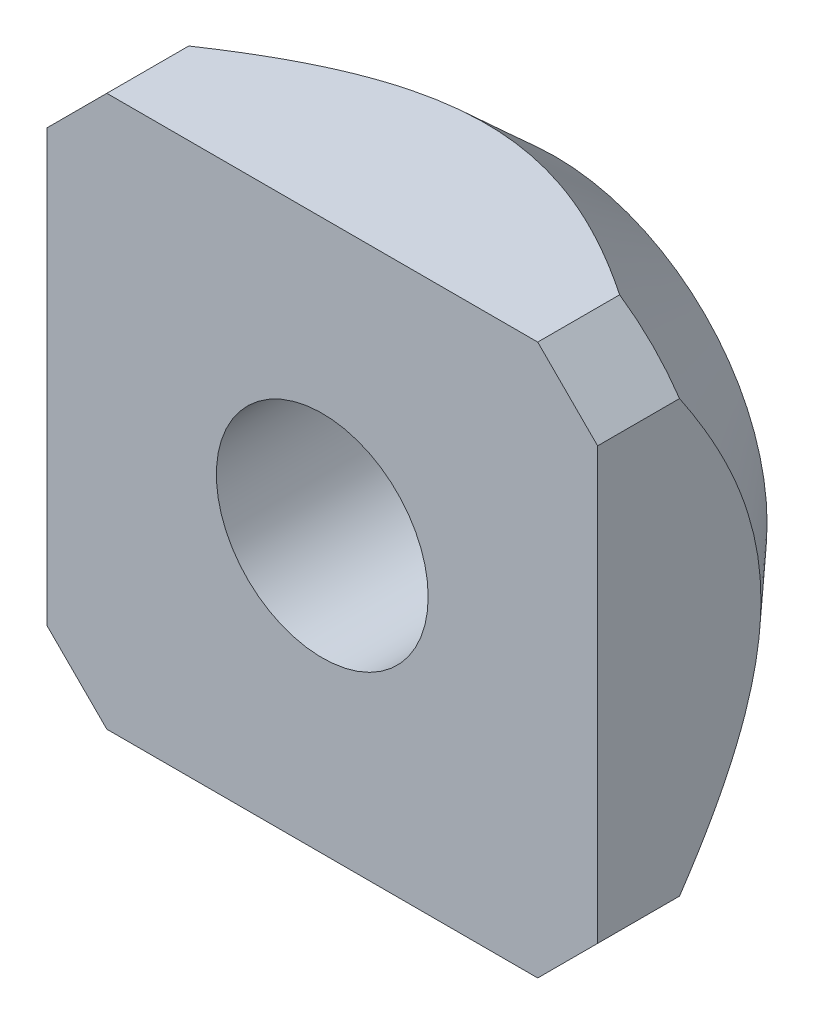
ISO-10303-21;
HEADER;
FILE_DESCRIPTION(('STEP AP214'),'2;1');
FILE_NAME('part.step','',(''),(''),'','','');
FILE_SCHEMA(('AUTOMOTIVE_DESIGN { 1 0 10303 214 1 1 1 1 }'));
ENDSEC;
DATA;
#1=APPLICATION_CONTEXT('core data for automotive mechanical design processes');
#2=APPLICATION_PROTOCOL_DEFINITION('international standard','automotive_design',2000,#1);
#3=PRODUCT_CONTEXT('',#1,'mechanical');
#4=PRODUCT('Part','Part','',(#3));
#5=PRODUCT_RELATED_PRODUCT_CATEGORY('part','',(#4));
#6=PRODUCT_DEFINITION_FORMATION('','',#4);
#7=PRODUCT_DEFINITION_CONTEXT('part definition',#1,'design');
#8=PRODUCT_DEFINITION('design','',#6,#7);
#9=PRODUCT_DEFINITION_SHAPE('','',#8);
#10=(LENGTH_UNIT() NAMED_UNIT(*) SI_UNIT(.MILLI.,.METRE.));
#11=(NAMED_UNIT(*) PLANE_ANGLE_UNIT() SI_UNIT($,.RADIAN.));
#12=(NAMED_UNIT(*) SI_UNIT($,.STERADIAN.) SOLID_ANGLE_UNIT());
#13=UNCERTAINTY_MEASURE_WITH_UNIT(LENGTH_MEASURE(1.E-05),#10,'distance_accuracy_value','');
#14=(GEOMETRIC_REPRESENTATION_CONTEXT(3) GLOBAL_UNCERTAINTY_ASSIGNED_CONTEXT((#13)) GLOBAL_UNIT_ASSIGNED_CONTEXT((#10,
#11,#12)) REPRESENTATION_CONTEXT('',''));
#15=CARTESIAN_POINT('',(0.,0.,0.));
#16=DIRECTION('',(0.,0.,1.));
#17=DIRECTION('',(1.,0.,0.));
#18=AXIS2_PLACEMENT_3D('',#15,#16,#17);
#19=CARTESIAN_POINT('',(0.,0.,-5.5));
#20=DIRECTION('',(0.,0.,1.));
#21=DIRECTION('',(1.,0.,0.));
#22=AXIS2_PLACEMENT_3D('',#19,#20,#21);
#23=PLANE('',#22);
#24=CARTESIAN_POINT('',(0.,0.,-5.5));
#25=DIRECTION('',(0.,0.,1.));
#26=DIRECTION('',(1.,0.,0.));
#27=AXIS2_PLACEMENT_3D('',#24,#25,#26);
#28=CIRCLE('',#27,2.5);
#29=CARTESIAN_POINT('',(2.5,0.,-5.5));
#30=VERTEX_POINT('',#29);
#31=EDGE_CURVE('E246',#30,#30,#28,.T.);
#32=ORIENTED_EDGE('',*,*,#31,.T.);
#33=EDGE_LOOP('',(#32));
#34=FACE_BOUND('',#33,.T.);
#35=CARTESIAN_POINT('',(0.,0.,-5.50000000287154));
#36=DIRECTION('',(0.,0.,1.));
#37=DIRECTION('',(1.,0.,0.));
#38=AXIS2_PLACEMENT_3D('',#35,#36,#37);
#39=CIRCLE('',#38,5.00000000314824);
#40=CARTESIAN_POINT('',(5.00000000314824,0.,-5.50000000287154));
#41=VERTEX_POINT('',#40);
#42=EDGE_CURVE('E33',#41,#41,#39,.T.);
#43=ORIENTED_EDGE('',*,*,#42,.F.);
#44=EDGE_LOOP('',(#43));
#45=FACE_BOUND('',#44,.T.);
#46=ADVANCED_FACE('F30',(#34,#45),#23,.F.);
#47=CARTESIAN_POINT('',(0.,0.,-1.91193420733516));
#48=DIRECTION('',(0.,0.,1.));
#49=DIRECTION('',(1.,0.,0.));
#50=AXIS2_PLACEMENT_3D('',#47,#48,#49);
#51=CONICAL_SURFACE('',#50,8.27271392518171,0.739466056088912);
#52=ORIENTED_EDGE('',*,*,#42,.T.);
#53=EDGE_LOOP('',(#52));
#54=FACE_BOUND('',#53,.T.);
#55=CARTESIAN_POINT('',(-6.49999999996656,5.08578643774263,-1.93333420218814));
#56=CARTESIAN_POINT('',(-6.49999999998799,4.97217656549041,-2.01007902749409));
#57=CARTESIAN_POINT('',(-6.49999999999678,4.85782950972393,-2.08574579284289));
#58=CARTESIAN_POINT('',(-6.50000000000322,4.62749756275461,-2.23459577320099));
#59=CARTESIAN_POINT('',(-6.50000000000086,4.51151233122406,-2.30777846107305));
#60=CARTESIAN_POINT('',(-6.49999999999913,4.27735001893202,-2.45156937006614));
#61=CARTESIAN_POINT('',(-6.49999999999976,4.15916634847437,-2.52216690472437));
#62=CARTESIAN_POINT('',(-6.50000000000024,3.92090179825337,-2.66006146574261));
#63=CARTESIAN_POINT('',(-6.50000000000008,3.80082102170299,-2.72735867084667));
#64=CARTESIAN_POINT('',(-6.49999999999983,3.43117049901182,-2.927024197621));
#65=CARTESIAN_POINT('',(-6.49999999999995,3.17828163281151,-3.05336340735418));
#66=CARTESIAN_POINT('',(-6.50000000000004,2.66320472724055,-3.2847897494762));
#67=CARTESIAN_POINT('',(-6.50000000000001,2.40103115726329,-3.38990837532806));
#68=CARTESIAN_POINT('',(-6.49999999999999,1.96194937878003,-3.54007016332442));
#69=CARTESIAN_POINT('',(-6.5,1.78780916432668,-3.5931930058844));
#70=CARTESIAN_POINT('',(-6.5,1.43593803357401,-3.68604206605222));
#71=CARTESIAN_POINT('',(-6.5,1.25820705951024,-3.72576806796325));
#72=CARTESIAN_POINT('',(-6.5,0.901971243864608,-3.78972854936986));
#73=CARTESIAN_POINT('',(-6.5,0.723496609813822,-3.81412921930872));
#74=CARTESIAN_POINT('',(-6.5,0.365074863040264,-3.84691624104865));
#75=CARTESIAN_POINT('',(-6.5,0.185127876429945,-3.85530395029257));
#76=CARTESIAN_POINT('',(-6.5,-0.175331996863656,-3.85561829853934));
#77=CARTESIAN_POINT('',(-6.5,-0.355844930170432,-3.84749448568778));
#78=CARTESIAN_POINT('',(-6.5,-0.715412000901114,-3.81512247996494));
#79=CARTESIAN_POINT('',(-6.5,-0.894466007670494,-3.79087285866508));
#80=CARTESIAN_POINT('',(-6.5,-1.25186987190293,-3.72710369302864));
#81=CARTESIAN_POINT('',(-6.5,-1.43018938883302,-3.6874161876482));
#82=CARTESIAN_POINT('',(-6.5,-1.7832209983363,-3.59454247061222));
#83=CARTESIAN_POINT('',(-6.5,-1.95793314761956,-3.54135647133646));
#84=CARTESIAN_POINT('',(-6.5,-2.39791270686289,-3.39110767153733));
#85=CARTESIAN_POINT('',(-6.5,-2.66041462883235,-3.2859613732665));
#86=CARTESIAN_POINT('',(-6.5,-3.17612601907367,-3.05441341529704));
#87=CARTESIAN_POINT('',(-6.5,-3.4293209389517,-2.92798006949308));
#88=CARTESIAN_POINT('',(-6.5,-3.79940591229883,-2.72814379751195));
#89=CARTESIAN_POINT('',(-6.5,-3.91962359960432,-2.66078705978884));
#90=CARTESIAN_POINT('',(-6.5,-4.15815744619399,-2.52276484072712));
#91=CARTESIAN_POINT('',(-6.5,-4.27647350172637,-2.45209917967338));
#92=CARTESIAN_POINT('',(-6.5,-4.510894297226,-2.30816632365151));
#93=CARTESIAN_POINT('',(-6.5,-4.62700566745187,-2.23490988206234));
#94=CARTESIAN_POINT('',(-6.5,-4.85758619181249,-2.08590677964123));
#95=CARTESIAN_POINT('',(-6.5,-4.97205568825616,-2.01016064904319));
#96=CARTESIAN_POINT('',(-6.5,-5.08578643774838,-1.93333420220499));
#97=B_SPLINE_CURVE_WITH_KNOTS('',3,(#55,#56,#57,#58,#59,#60,#61,#62,#63,#64,#65,#66,#67,#68,#69,
#70,#71,#72,#73,#74,#75,#76,#77,#78,#79,#80,#81,#82,#83,#84,#85,#86,#87,#88,#89,#90,#91,#92,#93,
#94,#95,#96),.UNSPECIFIED.,.F.,.F.,(4,2,2,2,2,2,2,2,2,2,2,2,2,2,2,2,2,2,2,2,4),(0.,
0.41131042679013,0.822707597462602,1.23564791332838,1.64856583981778,2.49590493844257,
3.34197710361053,3.88772071571207,4.43347311417834,4.97320018567055,5.51288150165221,
6.05421432221896,6.59559510058552,7.1430386002873,7.69047348727104,8.53748456918338,
9.38576777125056,9.79913116863559,10.2125170428237,10.6243522063669,11.0361002217524),.UNSPECIFIED.);
#98=CARTESIAN_POINT('',(-6.50000000001247,5.08578643767711,-1.93333420224238));
#99=VERTEX_POINT('',#98);
#100=CARTESIAN_POINT('',(-6.50000000001247,-5.08578643767711,-1.93333420224238));
#101=VERTEX_POINT('',#100);
#102=EDGE_CURVE('E159',#99,#101,#97,.T.);
#103=ORIENTED_EDGE('',*,*,#102,.F.);
#104=CARTESIAN_POINT('',(-5.08578643758324,6.50000000000418,-1.93333420227152));
#105=CARTESIAN_POINT('',(-5.20320338743552,6.38258305017716,-1.95544496406807));
#106=CARTESIAN_POINT('',(-5.32114245529566,6.26464398232743,-1.97213629505099));
#107=CARTESIAN_POINT('',(-5.55702028333326,6.02876615429746,-1.99438943436884));
#108=CARTESIAN_POINT('',(-5.6749567510727,5.9108296865553,-2.00000000038364));
#109=CARTESIAN_POINT('',(-5.91082968655301,5.67495675107281,-2.00000000038308));
#110=CARTESIAN_POINT('',(-6.02876615429389,5.55702028333248,-1.99438943436772));
#111=CARTESIAN_POINT('',(-6.2646439823281,5.32114245529936,-1.97213629505239));
#112=CARTESIAN_POINT('',(-6.38258305018337,5.20320338744464,-1.95544496407257));
#113=CARTESIAN_POINT('',(-6.50000000002287,5.08578643760404,-1.93333420228277));
#114=B_SPLINE_CURVE_WITH_KNOTS('',3,(#104,#105,#106,#107,#108,#109,#110,#111,#112,#113),
.UNSPECIFIED.,.F.,.F.,(4,2,2,2,4),(0.,0.502492195093159,1.00276834929097,1.50304450348823,
2.00553669858084),.UNSPECIFIED.);
#115=CARTESIAN_POINT('',(-5.08578643767711,6.50000000001248,-1.93333420224238));
#116=VERTEX_POINT('',#115);
#117=EDGE_CURVE('E165',#116,#99,#114,.T.);
#118=ORIENTED_EDGE('',*,*,#117,.F.);
#119=CARTESIAN_POINT('',(5.08578643774263,6.49999999996657,-1.93333420218813));
#120=CARTESIAN_POINT('',(4.9721765654904,6.49999999998799,-2.01007902749409));
#121=CARTESIAN_POINT('',(4.85782950972392,6.49999999999678,-2.08574579284289));
#122=CARTESIAN_POINT('',(4.62749756275461,6.50000000000322,-2.23459577320099));
#123=CARTESIAN_POINT('',(4.51151233122406,6.50000000000087,-2.30777846107305));
#124=CARTESIAN_POINT('',(4.27735001893202,6.49999999999913,-2.45156937006614));
#125=CARTESIAN_POINT('',(4.15916634847437,6.49999999999976,-2.52216690472436));
#126=CARTESIAN_POINT('',(3.92090179825336,6.50000000000024,-2.66006146574261));
#127=CARTESIAN_POINT('',(3.80082102170299,6.50000000000009,-2.72735867084667));
#128=CARTESIAN_POINT('',(3.43117049901181,6.49999999999983,-2.927024197621));
#129=CARTESIAN_POINT('',(3.17828163281151,6.49999999999996,-3.05336340735418));
#130=CARTESIAN_POINT('',(2.66320472724054,6.50000000000005,-3.2847897494762));
#131=CARTESIAN_POINT('',(2.40103115726328,6.50000000000001,-3.38990837532806));
#132=CARTESIAN_POINT('',(1.96194937878002,6.5,-3.54007016332442));
#133=CARTESIAN_POINT('',(1.78780916432667,6.5,-3.5931930058844));
#134=CARTESIAN_POINT('',(1.435938033574,6.50000000000001,-3.68604206605221));
#135=CARTESIAN_POINT('',(1.25820705951023,6.5,-3.72576806796325));
#136=CARTESIAN_POINT('',(0.901971243864601,6.5,-3.78972854936986));
#137=CARTESIAN_POINT('',(0.723496609813815,6.5,-3.81412921930872));
#138=CARTESIAN_POINT('',(0.365074863040257,6.5,-3.84691624104865));
#139=CARTESIAN_POINT('',(0.185127876429939,6.5,-3.85530395029256));
#140=CARTESIAN_POINT('',(-0.175331996863662,6.5,-3.85561829853934));
#141=CARTESIAN_POINT('',(-0.355844930170438,6.5,-3.84749448568778));
#142=CARTESIAN_POINT('',(-0.715412000901119,6.5,-3.81512247996494));
#143=CARTESIAN_POINT('',(-0.8944660076705,6.5,-3.79087285866508));
#144=CARTESIAN_POINT('',(-1.25186987190293,6.5,-3.72710369302863));
#145=CARTESIAN_POINT('',(-1.43018938883303,6.5,-3.68741618764819));
#146=CARTESIAN_POINT('',(-1.7832209983363,6.5,-3.59454247061221));
#147=CARTESIAN_POINT('',(-1.95793314761956,6.5,-3.54135647133646));
#148=CARTESIAN_POINT('',(-2.3979127068629,6.5,-3.39110767153733));
#149=CARTESIAN_POINT('',(-2.66041462883235,6.5,-3.2859613732665));
#150=CARTESIAN_POINT('',(-3.17612601907368,6.5,-3.05441341529704));
#151=CARTESIAN_POINT('',(-3.4293209389517,6.5,-2.92798006949307));
#152=CARTESIAN_POINT('',(-3.79940591229883,6.5,-2.72814379751195));
#153=CARTESIAN_POINT('',(-3.91962359960432,6.5,-2.66078705978884));
#154=CARTESIAN_POINT('',(-4.15815744619399,6.5,-2.52276484072712));
#155=CARTESIAN_POINT('',(-4.27647350172636,6.5,-2.45209917967338));
#156=CARTESIAN_POINT('',(-4.510894297226,6.5,-2.30816632365151));
#157=CARTESIAN_POINT('',(-4.62700566745187,6.5,-2.23490988206234));
#158=CARTESIAN_POINT('',(-4.85758619181248,6.5,-2.08590677964123));
#159=CARTESIAN_POINT('',(-4.97205568825616,6.5,-2.01016064904319));
#160=CARTESIAN_POINT('',(-5.08578643774838,6.5,-1.93333420220499));
#161=B_SPLINE_CURVE_WITH_KNOTS('',3,(#119,#120,#121,#122,#123,#124,#125,#126,#127,#128,#129,
#130,#131,#132,#133,#134,#135,#136,#137,#138,#139,#140,#141,#142,#143,#144,#145,#146,#147,#148,
#149,#150,#151,#152,#153,#154,#155,#156,#157,#158,#159,#160),.UNSPECIFIED.,.F.,.F.,(4,2,2,2,2,2,
2,2,2,2,2,2,2,2,2,2,2,2,2,2,4),(0.,0.411310426790131,0.822707597462601,1.23564791332838,
1.64856583981778,2.49590493844257,3.34197710361053,3.88772071571208,4.43347311417834,
4.97320018567055,5.51288150165221,6.05421432221896,6.59559510058552,7.1430386002873,
7.69047348727104,8.53748456918337,9.38576777125056,9.79913116863558,10.2125170428237,
10.6243522063669,11.0361002217524),.UNSPECIFIED.);
#162=CARTESIAN_POINT('',(5.08578643767711,6.50000000001247,-1.93333420224238));
#163=VERTEX_POINT('',#162);
#164=EDGE_CURVE('E99',#163,#116,#161,.T.);
#165=ORIENTED_EDGE('',*,*,#164,.F.);
#166=CARTESIAN_POINT('',(6.50000000000418,5.08578643758324,-1.93333420227152));
#167=CARTESIAN_POINT('',(6.38258305017715,5.20320338743553,-1.95544496406807));
#168=CARTESIAN_POINT('',(6.26464398232743,5.32114245529566,-1.97213629505098));
#169=CARTESIAN_POINT('',(6.02876615429745,5.55702028333326,-1.99438943436883));
#170=CARTESIAN_POINT('',(5.9108296865553,5.6749567510727,-2.00000000038364));
#171=CARTESIAN_POINT('',(5.67495675107281,5.91082968655302,-2.00000000038307));
#172=CARTESIAN_POINT('',(5.55702028333247,6.02876615429389,-1.99438943436771));
#173=CARTESIAN_POINT('',(5.32114245529936,6.2646439823281,-1.97213629505239));
#174=CARTESIAN_POINT('',(5.20320338744464,6.38258305018337,-1.95544496407257));
#175=CARTESIAN_POINT('',(5.08578643760404,6.50000000002287,-1.93333420228276));
#176=B_SPLINE_CURVE_WITH_KNOTS('',3,(#166,#167,#168,#169,#170,#171,#172,#173,#174,#175),
.UNSPECIFIED.,.F.,.F.,(4,2,2,2,4),(0.,0.502492195093158,1.00276834929097,1.50304450348823,
2.00553669858084),.UNSPECIFIED.);
#177=CARTESIAN_POINT('',(6.50000000001247,5.08578643761444,-1.93333420228472));
#178=VERTEX_POINT('',#177);
#179=EDGE_CURVE('E93',#178,#163,#176,.T.);
#180=ORIENTED_EDGE('',*,*,#179,.F.);
#181=CARTESIAN_POINT('',(6.49999999996656,-5.08578643774263,-1.93333420218813));
#182=CARTESIAN_POINT('',(6.49999999998799,-4.97217656549041,-2.01007902749409));
#183=CARTESIAN_POINT('',(6.49999999999678,-4.85782950972392,-2.08574579284288));
#184=CARTESIAN_POINT('',(6.50000000000322,-4.62749756275461,-2.23459577320098));
#185=CARTESIAN_POINT('',(6.50000000000087,-4.51151233122406,-2.30777846107305));
#186=CARTESIAN_POINT('',(6.49999999999913,-4.27735001893202,-2.45156937006614));
#187=CARTESIAN_POINT('',(6.49999999999976,-4.15916634847437,-2.52216690472436));
#188=CARTESIAN_POINT('',(6.50000000000024,-3.92090179825336,-2.6600614657426));
#189=CARTESIAN_POINT('',(6.50000000000008,-3.80082102170299,-2.72735867084666));
#190=CARTESIAN_POINT('',(6.49999999999983,-3.43117049901182,-2.927024197621));
#191=CARTESIAN_POINT('',(6.49999999999996,-3.17828163281151,-3.05336340735417));
#192=CARTESIAN_POINT('',(6.50000000000005,-2.66320472724054,-3.2847897494762));
#193=CARTESIAN_POINT('',(6.50000000000001,-2.40103115726328,-3.38990837532806));
#194=CARTESIAN_POINT('',(6.49999999999999,-1.96194937878003,-3.54007016332441));
#195=CARTESIAN_POINT('',(6.5,-1.78780916432667,-3.5931930058844));
#196=CARTESIAN_POINT('',(6.5,-1.435938033574,-3.68604206605221));
#197=CARTESIAN_POINT('',(6.5,-1.25820705951023,-3.72576806796324));
#198=CARTESIAN_POINT('',(6.5,-0.901971243864601,-3.78972854936985));
#199=CARTESIAN_POINT('',(6.5,-0.723496609813815,-3.81412921930872));
#200=CARTESIAN_POINT('',(6.5,-0.365074863040257,-3.84691624104865));
#201=CARTESIAN_POINT('',(6.5,-0.185127876429938,-3.85530395029256));
#202=CARTESIAN_POINT('',(6.5,0.175331996863663,-3.85561829853934));
#203=CARTESIAN_POINT('',(6.5,0.355844930170439,-3.84749448568778));
#204=CARTESIAN_POINT('',(6.5,0.715412000901121,-3.81512247996494));
#205=CARTESIAN_POINT('',(6.5,0.894466007670502,-3.79087285866508));
#206=CARTESIAN_POINT('',(6.5,1.25186987190294,-3.72710369302863));
#207=CARTESIAN_POINT('',(6.5,1.43018938883303,-3.68741618764819));
#208=CARTESIAN_POINT('',(6.5,1.7832209983363,-3.59454247061221));
#209=CARTESIAN_POINT('',(6.5,1.95793314761957,-3.54135647133646));
#210=CARTESIAN_POINT('',(6.5,2.3979127068629,-3.39110767153733));
#211=CARTESIAN_POINT('',(6.5,2.66041462883236,-3.2859613732665));
#212=CARTESIAN_POINT('',(6.5,3.17612601907368,-3.05441341529703));
#213=CARTESIAN_POINT('',(6.5,3.42932093895171,-2.92798006949307));
#214=CARTESIAN_POINT('',(6.5,3.79940591229883,-2.72814379751194));
#215=CARTESIAN_POINT('',(6.5,3.91962359960432,-2.66078705978883));
#216=CARTESIAN_POINT('',(6.5,4.15815744619399,-2.52276484072711));
#217=CARTESIAN_POINT('',(6.5,4.27647350172637,-2.45209917967337));
#218=CARTESIAN_POINT('',(6.5,4.51089429722601,-2.30816632365151));
#219=CARTESIAN_POINT('',(6.5,4.62700566745188,-2.23490988206234));
#220=CARTESIAN_POINT('',(6.5,4.85758619181249,-2.08590677964122));
#221=CARTESIAN_POINT('',(6.5,4.97205568825616,-2.01016064904319));
#222=CARTESIAN_POINT('',(6.5,5.08578643774839,-1.93333420220499));
#223=B_SPLINE_CURVE_WITH_KNOTS('',3,(#181,#182,#183,#184,#185,#186,#187,#188,#189,#190,#191,
#192,#193,#194,#195,#196,#197,#198,#199,#200,#201,#202,#203,#204,#205,#206,#207,#208,#209,#210,
#211,#212,#213,#214,#215,#216,#217,#218,#219,#220,#221,#222),.UNSPECIFIED.,.F.,.F.,(4,2,2,2,2,2,
2,2,2,2,2,2,2,2,2,2,2,2,2,2,4),(0.,0.411310426790131,0.822707597462602,1.23564791332838,
1.64856583981778,2.49590493844257,3.34197710361053,3.88772071571208,4.43347311417835,
4.97320018567056,5.51288150165222,6.05421432221896,6.59559510058553,7.14303860028731,
7.69047348727105,8.53748456918338,9.38576777125057,9.79913116863559,10.2125170428237,
10.6243522063669,11.0361002217524),.UNSPECIFIED.);
#224=CARTESIAN_POINT('',(6.50000000001247,-5.08578643767711,-1.93333420224237));
#225=VERTEX_POINT('',#224);
#226=EDGE_CURVE('E97',#225,#178,#223,.T.);
#227=ORIENTED_EDGE('',*,*,#226,.F.);
#228=CARTESIAN_POINT('',(5.08578643758324,-6.50000000000418,-1.93333420227152));
#229=CARTESIAN_POINT('',(5.20320338743552,-6.38258305017716,-1.95544496406807));
#230=CARTESIAN_POINT('',(5.32114245529566,-6.26464398232743,-1.97213629505098));
#231=CARTESIAN_POINT('',(5.55702028333326,-6.02876615429746,-1.99438943436883));
#232=CARTESIAN_POINT('',(5.6749567510727,-5.9108296865553,-2.00000000038364));
#233=CARTESIAN_POINT('',(5.91082968655301,-5.67495675107281,-2.00000000038307));
#234=CARTESIAN_POINT('',(6.02876615429389,-5.55702028333248,-1.99438943436771));
#235=CARTESIAN_POINT('',(6.2646439823281,-5.32114245529936,-1.97213629505238));
#236=CARTESIAN_POINT('',(6.38258305018337,-5.20320338744464,-1.95544496407256));
#237=CARTESIAN_POINT('',(6.50000000002286,-5.08578643760405,-1.93333420228276));
#238=B_SPLINE_CURVE_WITH_KNOTS('',3,(#228,#229,#230,#231,#232,#233,#234,#235,#236,#237),
.UNSPECIFIED.,.F.,.F.,(4,2,2,2,4),(0.,0.502492195093158,1.00276834929097,1.50304450348823,
2.00553669858084),.UNSPECIFIED.);
#239=CARTESIAN_POINT('',(5.08578643767711,-6.50000000001247,-1.93333420224237));
#240=VERTEX_POINT('',#239);
#241=EDGE_CURVE('E113',#240,#225,#238,.T.);
#242=ORIENTED_EDGE('',*,*,#241,.F.);
#243=CARTESIAN_POINT('',(-5.08578643774262,-6.49999999996657,-1.93333420218813));
#244=CARTESIAN_POINT('',(-4.9721765654904,-6.49999999998799,-2.01007902749409));
#245=CARTESIAN_POINT('',(-4.85782950972392,-6.49999999999678,-2.08574579284288));
#246=CARTESIAN_POINT('',(-4.62749756275461,-6.50000000000322,-2.23459577320099));
#247=CARTESIAN_POINT('',(-4.51151233122405,-6.50000000000087,-2.30777846107305));
#248=CARTESIAN_POINT('',(-4.27735001893202,-6.49999999999913,-2.45156937006614));
#249=CARTESIAN_POINT('',(-4.15916634847437,-6.49999999999976,-2.52216690472436));
#250=CARTESIAN_POINT('',(-3.92090179825336,-6.50000000000024,-2.6600614657426));
#251=CARTESIAN_POINT('',(-3.80082102170298,-6.50000000000009,-2.72735867084667));
#252=CARTESIAN_POINT('',(-3.43117049901181,-6.49999999999983,-2.927024197621));
#253=CARTESIAN_POINT('',(-3.1782816328115,-6.49999999999996,-3.05336340735418));
#254=CARTESIAN_POINT('',(-2.66320472724054,-6.50000000000005,-3.2847897494762));
#255=CARTESIAN_POINT('',(-2.40103115726328,-6.50000000000001,-3.38990837532806));
#256=CARTESIAN_POINT('',(-1.96194937878002,-6.5,-3.54007016332441));
#257=CARTESIAN_POINT('',(-1.78780916432667,-6.5,-3.5931930058844));
#258=CARTESIAN_POINT('',(-1.435938033574,-6.5,-3.68604206605221));
#259=CARTESIAN_POINT('',(-1.25820705951023,-6.5,-3.72576806796324));
#260=CARTESIAN_POINT('',(-0.9019712438646,-6.5,-3.78972854936985));
#261=CARTESIAN_POINT('',(-0.723496609813814,-6.5,-3.81412921930872));
#262=CARTESIAN_POINT('',(-0.365074863040256,-6.5,-3.84691624104865));
#263=CARTESIAN_POINT('',(-0.185127876429937,-6.5,-3.85530395029256));
#264=CARTESIAN_POINT('',(0.175331996863664,-6.5,-3.85561829853933));
#265=CARTESIAN_POINT('',(0.35584493017044,-6.5,-3.84749448568777));
#266=CARTESIAN_POINT('',(0.715412000901122,-6.5,-3.81512247996493));
#267=CARTESIAN_POINT('',(0.894466007670503,-6.5,-3.79087285866508));
#268=CARTESIAN_POINT('',(1.25186987190294,-6.5,-3.72710369302863));
#269=CARTESIAN_POINT('',(1.43018938883303,-6.5,-3.68741618764819));
#270=CARTESIAN_POINT('',(1.7832209983363,-6.5,-3.59454247061221));
#271=CARTESIAN_POINT('',(1.95793314761957,-6.5,-3.54135647133645));
#272=CARTESIAN_POINT('',(2.3979127068629,-6.5,-3.39110767153732));
#273=CARTESIAN_POINT('',(2.66041462883236,-6.5,-3.28596137326649));
#274=CARTESIAN_POINT('',(3.17612601907368,-6.5,-3.05441341529703));
#275=CARTESIAN_POINT('',(3.42932093895171,-6.5,-2.92798006949307));
#276=CARTESIAN_POINT('',(3.79940591229883,-6.5,-2.72814379751194));
#277=CARTESIAN_POINT('',(3.91962359960432,-6.5,-2.66078705978883));
#278=CARTESIAN_POINT('',(4.15815744619399,-6.5,-2.52276484072711));
#279=CARTESIAN_POINT('',(4.27647350172637,-6.5,-2.45209917967337));
#280=CARTESIAN_POINT('',(4.510894297226,-6.5,-2.30816632365151));
#281=CARTESIAN_POINT('',(4.62700566745187,-6.5,-2.23490988206233));
#282=CARTESIAN_POINT('',(4.85758619181248,-6.5,-2.08590677964122));
#283=CARTESIAN_POINT('',(4.97205568825616,-6.5,-2.01016064904318));
#284=CARTESIAN_POINT('',(5.08578643774838,-6.5,-1.93333420220499));
#285=B_SPLINE_CURVE_WITH_KNOTS('',3,(#243,#244,#245,#246,#247,#248,#249,#250,#251,#252,#253,
#254,#255,#256,#257,#258,#259,#260,#261,#262,#263,#264,#265,#266,#267,#268,#269,#270,#271,#272,
#273,#274,#275,#276,#277,#278,#279,#280,#281,#282,#283,#284),.UNSPECIFIED.,.F.,.F.,(4,2,2,2,2,2,
2,2,2,2,2,2,2,2,2,2,2,2,2,2,4),(0.,0.411310426790131,0.822707597462601,1.23564791332838,
1.64856583981778,2.49590493844257,3.34197710361053,3.88772071571207,4.43347311417834,
4.97320018567055,5.51288150165221,6.05421432221896,6.59559510058552,7.1430386002873,
7.69047348727104,8.53748456918338,9.38576777125056,9.79913116863558,10.2125170428237,
10.6243522063669,11.0361002217524),.UNSPECIFIED.);
#286=CARTESIAN_POINT('',(-5.08578643767711,-6.50000000001247,-1.93333420224237));
#287=VERTEX_POINT('',#286);
#288=EDGE_CURVE('E146',#287,#240,#285,.T.);
#289=ORIENTED_EDGE('',*,*,#288,.F.);
#290=CARTESIAN_POINT('',(-6.50000000000418,-5.08578643758324,-1.93333420227152));
#291=CARTESIAN_POINT('',(-6.38258305017715,-5.20320338743553,-1.95544496406807));
#292=CARTESIAN_POINT('',(-6.26464398232743,-5.32114245529566,-1.97213629505099));
#293=CARTESIAN_POINT('',(-6.02876615429745,-5.55702028333326,-1.99438943436883));
#294=CARTESIAN_POINT('',(-5.9108296865553,-5.6749567510727,-2.00000000038364));
#295=CARTESIAN_POINT('',(-5.6749567510728,-5.91082968655301,-2.00000000038307));
#296=CARTESIAN_POINT('',(-5.55702028333247,-6.02876615429389,-1.99438943436771));
#297=CARTESIAN_POINT('',(-5.32114245529935,-6.2646439823281,-1.97213629505239));
#298=CARTESIAN_POINT('',(-5.20320338744463,-6.38258305018337,-1.95544496407257));
#299=CARTESIAN_POINT('',(-5.08578643760404,-6.50000000002287,-1.93333420228276));
#300=B_SPLINE_CURVE_WITH_KNOTS('',3,(#290,#291,#292,#293,#294,#295,#296,#297,#298,#299),
.UNSPECIFIED.,.F.,.F.,(4,2,2,2,4),(0.,0.50249219509316,1.00276834929097,1.50304450348824,
2.00553669858085),.UNSPECIFIED.);
#301=EDGE_CURVE('E153',#101,#287,#300,.T.);
#302=ORIENTED_EDGE('',*,*,#301,.F.);
#303=EDGE_LOOP('',(#103,#118,#165,#180,#227,#242,#289,#302));
#304=FACE_BOUND('',#303,.T.);
#305=ADVANCED_FACE('F95',(#54,#304),#51,.T.);
#306=CARTESIAN_POINT('',(6.5,5.08578643762691,0.));
#307=DIRECTION('',(0.707106781186548,0.707106781186548,0.));
#308=DIRECTION('',(-0.707106781186548,0.707106781186548,0.));
#309=AXIS2_PLACEMENT_3D('',#306,#307,#308);
#310=PLANE('',#309);
#311=DIRECTION('',(-0.707106781186547,0.707106781186547,0.));
#312=VECTOR('',#311,1.);
#313=CARTESIAN_POINT('',(6.5,5.08578643762691,0.));
#314=LINE('',#313,#312);
#315=CARTESIAN_POINT('',(6.5,5.08578643762691,0.));
#316=VERTEX_POINT('',#315);
#317=CARTESIAN_POINT('',(5.08578643762691,6.5,0.));
#318=VERTEX_POINT('',#317);
#319=EDGE_CURVE('E106',#316,#318,#314,.T.);
#320=ORIENTED_EDGE('',*,*,#319,.F.);
#321=DIRECTION('',(0.,0.,-1.));
#322=VECTOR('',#321,1.);
#323=CARTESIAN_POINT('',(6.5,5.08578643762691,0.));
#324=LINE('',#323,#322);
#325=EDGE_CURVE('E103',#178,#316,#324,.F.);
#326=ORIENTED_EDGE('',*,*,#325,.F.);
#327=ORIENTED_EDGE('',*,*,#179,.T.);
#328=DIRECTION('',(0.,0.,1.));
#329=VECTOR('',#328,1.);
#330=CARTESIAN_POINT('',(5.08578643762691,6.5,0.));
#331=LINE('',#330,#329);
#332=EDGE_CURVE('E172',#318,#163,#331,.F.);
#333=ORIENTED_EDGE('',*,*,#332,.F.);
#334=EDGE_LOOP('',(#320,#326,#327,#333));
#335=FACE_BOUND('',#334,.T.);
#336=ADVANCED_FACE('F104',(#335),#310,.T.);
#337=CARTESIAN_POINT('',(5.08578643762691,6.5,0.));
#338=DIRECTION('',(0.,1.,0.));
#339=DIRECTION('',(0.,0.,1.));
#340=AXIS2_PLACEMENT_3D('',#337,#338,#339);
#341=PLANE('',#340);
#342=DIRECTION('',(1.,0.,0.));
#343=VECTOR('',#342,1.);
#344=CARTESIAN_POINT('',(0.,6.5,0.));
#345=LINE('',#344,#343);
#346=CARTESIAN_POINT('',(-5.0857864376269,6.50000000000001,0.));
#347=VERTEX_POINT('',#346);
#348=EDGE_CURVE('E121',#318,#347,#345,.F.);
#349=ORIENTED_EDGE('',*,*,#348,.F.);
#350=ORIENTED_EDGE('',*,*,#332,.T.);
#351=ORIENTED_EDGE('',*,*,#164,.T.);
#352=DIRECTION('',(0.,0.,1.));
#353=VECTOR('',#352,1.);
#354=CARTESIAN_POINT('',(-5.0857864376269,6.50000000000001,0.));
#355=LINE('',#354,#353);
#356=EDGE_CURVE('E171',#347,#116,#355,.F.);
#357=ORIENTED_EDGE('',*,*,#356,.F.);
#358=EDGE_LOOP('',(#349,#350,#351,#357));
#359=FACE_BOUND('',#358,.T.);
#360=ADVANCED_FACE('F180',(#359),#341,.T.);
#361=CARTESIAN_POINT('',(-5.0857864376269,6.50000000000001,0.));
#362=DIRECTION('',(-0.707106781186548,0.707106781186548,0.));
#363=DIRECTION('',(-0.707106781186548,-0.707106781186548,0.));
#364=AXIS2_PLACEMENT_3D('',#361,#362,#363);
#365=PLANE('',#364);
#366=DIRECTION('',(-0.707106781186547,-0.707106781186547,0.));
#367=VECTOR('',#366,1.);
#368=CARTESIAN_POINT('',(-5.0857864376269,6.50000000000001,0.));
#369=LINE('',#368,#367);
#370=CARTESIAN_POINT('',(-6.5,5.08578643762691,0.));
#371=VERTEX_POINT('',#370);
#372=EDGE_CURVE('E219',#347,#371,#369,.T.);
#373=ORIENTED_EDGE('',*,*,#372,.F.);
#374=ORIENTED_EDGE('',*,*,#356,.T.);
#375=ORIENTED_EDGE('',*,*,#117,.T.);
#376=DIRECTION('',(0.,0.,1.));
#377=VECTOR('',#376,1.);
#378=CARTESIAN_POINT('',(-6.5,5.08578643762691,0.));
#379=LINE('',#378,#377);
#380=EDGE_CURVE('E226',#371,#99,#379,.F.);
#381=ORIENTED_EDGE('',*,*,#380,.F.);
#382=EDGE_LOOP('',(#373,#374,#375,#381));
#383=FACE_BOUND('',#382,.T.);
#384=ADVANCED_FACE('F176',(#383),#365,.T.);
#385=CARTESIAN_POINT('',(-6.5,5.08578643762691,0.));
#386=DIRECTION('',(-1.,0.,0.));
#387=DIRECTION('',(0.,0.,1.));
#388=AXIS2_PLACEMENT_3D('',#385,#386,#387);
#389=PLANE('',#388);
#390=DIRECTION('',(0.,1.,0.));
#391=VECTOR('',#390,1.);
#392=CARTESIAN_POINT('',(-6.5,0.,0.));
#393=LINE('',#392,#391);
#394=CARTESIAN_POINT('',(-6.5,-5.08578643762691,0.));
#395=VERTEX_POINT('',#394);
#396=EDGE_CURVE('E217',#371,#395,#393,.F.);
#397=ORIENTED_EDGE('',*,*,#396,.F.);
#398=ORIENTED_EDGE('',*,*,#380,.T.);
#399=ORIENTED_EDGE('',*,*,#102,.T.);
#400=DIRECTION('',(0.,0.,1.));
#401=VECTOR('',#400,1.);
#402=CARTESIAN_POINT('',(-6.5,-5.08578643762691,0.));
#403=LINE('',#402,#401);
#404=EDGE_CURVE('E232',#395,#101,#403,.F.);
#405=ORIENTED_EDGE('',*,*,#404,.F.);
#406=EDGE_LOOP('',(#397,#398,#399,#405));
#407=FACE_BOUND('',#406,.T.);
#408=ADVANCED_FACE('F179',(#407),#389,.T.);
#409=CARTESIAN_POINT('',(-6.5,-5.08578643762691,0.));
#410=DIRECTION('',(-0.707106781186548,-0.707106781186548,0.));
#411=DIRECTION('',(0.707106781186548,-0.707106781186548,0.));
#412=AXIS2_PLACEMENT_3D('',#409,#410,#411);
#413=PLANE('',#412);
#414=DIRECTION('',(0.707106781186547,-0.707106781186548,0.));
#415=VECTOR('',#414,1.);
#416=CARTESIAN_POINT('',(-6.5,-5.08578643762691,0.));
#417=LINE('',#416,#415);
#418=CARTESIAN_POINT('',(-5.08578643762691,-6.5,0.));
#419=VERTEX_POINT('',#418);
#420=EDGE_CURVE('E211',#395,#419,#417,.T.);
#421=ORIENTED_EDGE('',*,*,#420,.F.);
#422=ORIENTED_EDGE('',*,*,#404,.T.);
#423=ORIENTED_EDGE('',*,*,#301,.T.);
#424=DIRECTION('',(0.,0.,-1.));
#425=VECTOR('',#424,1.);
#426=CARTESIAN_POINT('',(-5.08578643762691,-6.5,0.));
#427=LINE('',#426,#425);
#428=EDGE_CURVE('E238',#419,#287,#427,.T.);
#429=ORIENTED_EDGE('',*,*,#428,.F.);
#430=EDGE_LOOP('',(#421,#422,#423,#429));
#431=FACE_BOUND('',#430,.T.);
#432=ADVANCED_FACE('F235',(#431),#413,.T.);
#433=CARTESIAN_POINT('',(-5.08578643762691,-6.5,0.));
#434=DIRECTION('',(0.,-1.,0.));
#435=DIRECTION('',(0.,0.,-1.));
#436=AXIS2_PLACEMENT_3D('',#433,#434,#435);
#437=PLANE('',#436);
#438=DIRECTION('',(1.,0.,0.));
#439=VECTOR('',#438,1.);
#440=CARTESIAN_POINT('',(0.,-6.5,0.));
#441=LINE('',#440,#439);
#442=CARTESIAN_POINT('',(5.08578643762691,-6.5,0.));
#443=VERTEX_POINT('',#442);
#444=EDGE_CURVE('E209',#419,#443,#441,.T.);
#445=ORIENTED_EDGE('',*,*,#444,.F.);
#446=ORIENTED_EDGE('',*,*,#428,.T.);
#447=ORIENTED_EDGE('',*,*,#288,.T.);
#448=DIRECTION('',(0.,0.,1.));
#449=VECTOR('',#448,1.);
#450=CARTESIAN_POINT('',(5.08578643762691,-6.5,0.));
#451=LINE('',#450,#449);
#452=EDGE_CURVE('E110',#443,#240,#451,.F.);
#453=ORIENTED_EDGE('',*,*,#452,.F.);
#454=EDGE_LOOP('',(#445,#446,#447,#453));
#455=FACE_BOUND('',#454,.T.);
#456=ADVANCED_FACE('F242',(#455),#437,.T.);
#457=CARTESIAN_POINT('',(5.08578643762691,-6.5,0.));
#458=DIRECTION('',(0.707106781186548,-0.707106781186548,0.));
#459=DIRECTION('',(0.707106781186548,0.707106781186548,0.));
#460=AXIS2_PLACEMENT_3D('',#457,#458,#459);
#461=PLANE('',#460);
#462=DIRECTION('',(0.707106781186547,0.707106781186548,0.));
#463=VECTOR('',#462,1.);
#464=CARTESIAN_POINT('',(5.08578643762691,-6.5,0.));
#465=LINE('',#464,#463);
#466=CARTESIAN_POINT('',(6.5,-5.08578643762691,0.));
#467=VERTEX_POINT('',#466);
#468=EDGE_CURVE('E39',#443,#467,#465,.T.);
#469=ORIENTED_EDGE('',*,*,#468,.F.);
#470=ORIENTED_EDGE('',*,*,#452,.T.);
#471=ORIENTED_EDGE('',*,*,#241,.T.);
#472=DIRECTION('',(0.,0.,-1.));
#473=VECTOR('',#472,1.);
#474=CARTESIAN_POINT('',(6.5,-5.08578643762691,0.));
#475=LINE('',#474,#473);
#476=EDGE_CURVE('E48',#467,#225,#475,.T.);
#477=ORIENTED_EDGE('',*,*,#476,.F.);
#478=EDGE_LOOP('',(#469,#470,#471,#477));
#479=FACE_BOUND('',#478,.T.);
#480=ADVANCED_FACE('F200',(#479),#461,.T.);
#481=CARTESIAN_POINT('',(6.5,-5.08578643762691,0.));
#482=DIRECTION('',(1.,0.,0.));
#483=DIRECTION('',(0.,0.,-1.));
#484=AXIS2_PLACEMENT_3D('',#481,#482,#483);
#485=PLANE('',#484);
#486=DIRECTION('',(0.,1.,0.));
#487=VECTOR('',#486,1.);
#488=CARTESIAN_POINT('',(6.5,0.,0.));
#489=LINE('',#488,#487);
#490=EDGE_CURVE('E11',#467,#316,#489,.T.);
#491=ORIENTED_EDGE('',*,*,#490,.F.);
#492=ORIENTED_EDGE('',*,*,#476,.T.);
#493=ORIENTED_EDGE('',*,*,#226,.T.);
#494=ORIENTED_EDGE('',*,*,#325,.T.);
#495=EDGE_LOOP('',(#491,#492,#493,#494));
#496=FACE_BOUND('',#495,.T.);
#497=ADVANCED_FACE('F109',(#496),#485,.T.);
#498=CARTESIAN_POINT('',(0.,0.,0.));
#499=DIRECTION('',(0.,0.,1.));
#500=DIRECTION('',(1.,0.,0.));
#501=AXIS2_PLACEMENT_3D('',#498,#499,#500);
#502=PLANE('',#501);
#503=CARTESIAN_POINT('',(0.,0.,0.));
#504=DIRECTION('',(0.,0.,1.));
#505=DIRECTION('',(1.,0.,0.));
#506=AXIS2_PLACEMENT_3D('',#503,#504,#505);
#507=CIRCLE('',#506,2.5);
#508=CARTESIAN_POINT('',(2.5,0.,0.));
#509=VERTEX_POINT('',#508);
#510=EDGE_CURVE('E204',#509,#509,#507,.T.);
#511=ORIENTED_EDGE('',*,*,#510,.F.);
#512=EDGE_LOOP('',(#511));
#513=FACE_BOUND('',#512,.T.);
#514=ORIENTED_EDGE('',*,*,#468,.T.);
#515=ORIENTED_EDGE('',*,*,#490,.T.);
#516=ORIENTED_EDGE('',*,*,#319,.T.);
#517=ORIENTED_EDGE('',*,*,#348,.T.);
#518=ORIENTED_EDGE('',*,*,#372,.T.);
#519=ORIENTED_EDGE('',*,*,#396,.T.);
#520=ORIENTED_EDGE('',*,*,#420,.T.);
#521=ORIENTED_EDGE('',*,*,#444,.T.);
#522=EDGE_LOOP('',(#514,#515,#516,#517,#518,#519,#520,#521));
#523=FACE_BOUND('',#522,.T.);
#524=ADVANCED_FACE('F190',(#513,#523),#502,.T.);
#525=CARTESIAN_POINT('',(0.,0.,0.));
#526=DIRECTION('',(0.,0.,1.));
#527=DIRECTION('',(1.,0.,0.));
#528=AXIS2_PLACEMENT_3D('',#525,#526,#527);
#529=CYLINDRICAL_SURFACE('',#528,2.5);
#530=ORIENTED_EDGE('',*,*,#510,.T.);
#531=EDGE_LOOP('',(#530));
#532=FACE_BOUND('',#531,.T.);
#533=ORIENTED_EDGE('',*,*,#31,.F.);
#534=EDGE_LOOP('',(#533));
#535=FACE_BOUND('',#534,.T.);
#536=ADVANCED_FACE('F192',(#532,#535),#529,.F.);
#537=CLOSED_SHELL('',(#46,#305,#336,#360,#384,#408,#432,#456,#480,#497,#524,#536));
#538=MANIFOLD_SOLID_BREP('B2',#537);
#539=ADVANCED_BREP_SHAPE_REPRESENTATION('',(#18,#538),#14);
#540=SHAPE_DEFINITION_REPRESENTATION(#9,#539);
ENDSEC;
END-ISO-10303-21;
